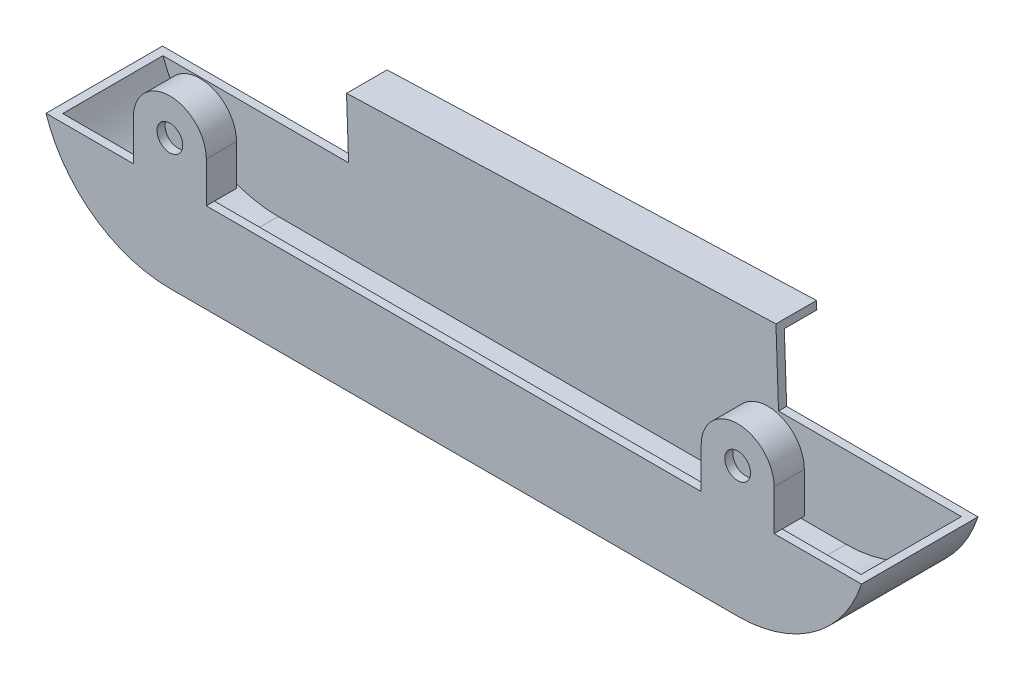
ISO-10303-21;
HEADER;
FILE_DESCRIPTION(('STEP AP214'),'2;1');
FILE_NAME('part.step','',(''),(''),'','','');
FILE_SCHEMA(('AUTOMOTIVE_DESIGN { 1 0 10303 214 1 1 1 1 }'));
ENDSEC;
DATA;
#1=APPLICATION_CONTEXT('core data for automotive mechanical design processes');
#2=APPLICATION_PROTOCOL_DEFINITION('international standard','automotive_design',2000,#1);
#3=PRODUCT_CONTEXT('',#1,'mechanical');
#4=PRODUCT('Part','Part','',(#3));
#5=PRODUCT_RELATED_PRODUCT_CATEGORY('part','',(#4));
#6=PRODUCT_DEFINITION_FORMATION('','',#4);
#7=PRODUCT_DEFINITION_CONTEXT('part definition',#1,'design');
#8=PRODUCT_DEFINITION('design','',#6,#7);
#9=PRODUCT_DEFINITION_SHAPE('','',#8);
#10=(LENGTH_UNIT() NAMED_UNIT(*) SI_UNIT(.MILLI.,.METRE.));
#11=(NAMED_UNIT(*) PLANE_ANGLE_UNIT() SI_UNIT($,.RADIAN.));
#12=(NAMED_UNIT(*) SI_UNIT($,.STERADIAN.) SOLID_ANGLE_UNIT());
#13=UNCERTAINTY_MEASURE_WITH_UNIT(LENGTH_MEASURE(1.E-05),#10,'distance_accuracy_value','');
#14=(GEOMETRIC_REPRESENTATION_CONTEXT(3) GLOBAL_UNCERTAINTY_ASSIGNED_CONTEXT((#13)) GLOBAL_UNIT_ASSIGNED_CONTEXT((#10,
#11,#12)) REPRESENTATION_CONTEXT('',''));
#15=CARTESIAN_POINT('',(0.,0.,0.));
#16=DIRECTION('',(0.,0.,1.));
#17=DIRECTION('',(1.,0.,0.));
#18=AXIS2_PLACEMENT_3D('',#15,#16,#17);
#19=CARTESIAN_POINT('',(0.,0.,0.));
#20=DIRECTION('',(0.,0.,1.));
#21=DIRECTION('',(1.,0.,0.));
#22=AXIS2_PLACEMENT_3D('',#19,#20,#21);
#23=PLANE('',#22);
#24=DIRECTION('',(-0.999389311897367,-0.0349428571428573,0.));
#25=VECTOR('',#24,1.);
#26=CARTESIAN_POINT('',(131.958867441707,15.7356294154201,0.));
#27=LINE('',#26,#25);
#28=CARTESIAN_POINT('',(131.958867441707,15.7356294154201,0.));
#29=VERTEX_POINT('',#28);
#30=CARTESIAN_POINT('',(-132.735647155993,6.48079498805815,0.));
#31=VERTEX_POINT('',#30);
#32=EDGE_CURVE('E96',#29,#31,#27,.T.);
#33=ORIENTED_EDGE('',*,*,#32,.F.);
#34=DIRECTION('',(-0.0349428571428576,0.999389311897368,0.));
#35=VECTOR('',#34,1.);
#36=CARTESIAN_POINT('',(132.34725729885,4.62741721368103,0.));
#37=LINE('',#36,#35);
#38=CARTESIAN_POINT('',(133.383156517387,-25.,0.));
#39=VERTEX_POINT('',#38);
#40=EDGE_CURVE('E325',#39,#29,#37,.T.);
#41=ORIENTED_EDGE('',*,*,#40,.F.);
#42=DIRECTION('',(-1.,0.,0.));
#43=VECTOR('',#42,1.);
#44=CARTESIAN_POINT('',(0.,-25.,0.));
#45=LINE('',#44,#43);
#46=CARTESIAN_POINT('',(251.338111427059,-25.,0.));
#47=VERTEX_POINT('',#46);
#48=EDGE_CURVE('E523',#47,#39,#45,.T.);
#49=ORIENTED_EDGE('',*,*,#48,.F.);
#50=CARTESIAN_POINT('',(175.,0.,0.));
#51=DIRECTION('',(0.,0.,1.));
#52=DIRECTION('',(1.,0.,0.));
#53=AXIS2_PLACEMENT_3D('',#50,#51,#52);
#54=CIRCLE('',#53,80.3275000000001);
#55=CARTESIAN_POINT('',(175.,-80.3275000000001,0.));
#56=VERTEX_POINT('',#55);
#57=EDGE_CURVE('E530',#56,#47,#54,.T.);
#58=ORIENTED_EDGE('',*,*,#57,.F.);
#59=DIRECTION('',(1.,0.,0.));
#60=VECTOR('',#59,1.);
#61=CARTESIAN_POINT('',(0.,-80.3275,0.));
#62=LINE('',#61,#60);
#63=CARTESIAN_POINT('',(-175.,-80.3275,0.));
#64=VERTEX_POINT('',#63);
#65=EDGE_CURVE('E528',#64,#56,#62,.T.);
#66=ORIENTED_EDGE('',*,*,#65,.F.);
#67=CARTESIAN_POINT('',(-175.,0.,0.));
#68=DIRECTION('',(0.,0.,1.));
#69=DIRECTION('',(1.,0.,0.));
#70=AXIS2_PLACEMENT_3D('',#67,#68,#69);
#71=CIRCLE('',#70,80.3275);
#72=CARTESIAN_POINT('',(-251.338111427058,-25.,0.));
#73=VERTEX_POINT('',#72);
#74=EDGE_CURVE('E526',#73,#64,#71,.T.);
#75=ORIENTED_EDGE('',*,*,#74,.F.);
#76=CARTESIAN_POINT('',(-131.634946048911,-25.,0.));
#77=VERTEX_POINT('',#76);
#78=EDGE_CURVE('E501',#77,#73,#45,.T.);
#79=ORIENTED_EDGE('',*,*,#78,.F.);
#80=DIRECTION('',(-0.0349428571428568,0.999389311897368,0.));
#81=VECTOR('',#80,1.);
#82=CARTESIAN_POINT('',(-132.34725729885,-4.62741721368092,0.));
#83=LINE('',#82,#81);
#84=EDGE_CURVE('E322',#77,#31,#83,.T.);
#85=ORIENTED_EDGE('',*,*,#84,.T.);
#86=EDGE_LOOP('',(#33,#41,#49,#58,#66,#75,#79,#85));
#87=FACE_BOUND('',#86,.T.);
#88=ADVANCED_FACE('F78',(#87),#23,.F.);
#89=CARTESIAN_POINT('',(0.,-25.,71.818));
#90=DIRECTION('',(0.,-1.,0.));
#91=DIRECTION('',(1.,0.,0.));
#92=AXIS2_PLACEMENT_3D('',#89,#90,#91);
#93=PLANE('',#92);
#94=DIRECTION('',(0.,0.,-1.));
#95=VECTOR('',#94,1.);
#96=CARTESIAN_POINT('',(133.383156517387,-25.,275.191980288703));
#97=LINE('',#96,#95);
#98=CARTESIAN_POINT('',(133.383156517387,-25.,5.));
#99=VERTEX_POINT('',#98);
#100=EDGE_CURVE('E327',#99,#39,#97,.T.);
#101=ORIENTED_EDGE('',*,*,#100,.F.);
#102=DIRECTION('',(-1.,0.,0.));
#103=VECTOR('',#102,1.);
#104=CARTESIAN_POINT('',(0.,-25.,5.));
#105=LINE('',#104,#103);
#106=CARTESIAN_POINT('',(246.057949986261,-25.,5.));
#107=VERTEX_POINT('',#106);
#108=EDGE_CURVE('E478',#107,#99,#105,.T.);
#109=ORIENTED_EDGE('',*,*,#108,.F.);
#110=DIRECTION('',(0.,0.,-1.));
#111=VECTOR('',#110,1.);
#112=CARTESIAN_POINT('',(246.057949986261,-25.,66.818));
#113=LINE('',#112,#111);
#114=CARTESIAN_POINT('',(246.057949986261,-25.,66.818));
#115=VERTEX_POINT('',#114);
#116=EDGE_CURVE('E492',#115,#107,#113,.T.);
#117=ORIENTED_EDGE('',*,*,#116,.F.);
#118=DIRECTION('',(-1.,0.,0.));
#119=VECTOR('',#118,1.);
#120=CARTESIAN_POINT('',(0.,-25.,66.818));
#121=LINE('',#120,#119);
#122=CARTESIAN_POINT('',(197.465,-25.,66.818));
#123=VERTEX_POINT('',#122);
#124=EDGE_CURVE('E487',#115,#123,#121,.T.);
#125=ORIENTED_EDGE('',*,*,#124,.T.);
#126=DIRECTION('',(0.,0.,1.));
#127=VECTOR('',#126,1.);
#128=CARTESIAN_POINT('',(197.465,-25.,53.182));
#129=LINE('',#128,#127);
#130=CARTESIAN_POINT('',(197.465,-25.,71.818));
#131=VERTEX_POINT('',#130);
#132=EDGE_CURVE('E425',#123,#131,#129,.T.);
#133=ORIENTED_EDGE('',*,*,#132,.T.);
#134=DIRECTION('',(-1.,0.,0.));
#135=VECTOR('',#134,1.);
#136=CARTESIAN_POINT('',(0.,-25.,71.818));
#137=LINE('',#136,#135);
#138=CARTESIAN_POINT('',(251.338111427059,-25.,71.818));
#139=VERTEX_POINT('',#138);
#140=EDGE_CURVE('E511',#139,#131,#137,.T.);
#141=ORIENTED_EDGE('',*,*,#140,.F.);
#142=DIRECTION('',(0.,0.,-1.));
#143=VECTOR('',#142,1.);
#144=CARTESIAN_POINT('',(251.338111427059,-25.,71.818));
#145=LINE('',#144,#143);
#146=EDGE_CURVE('E522',#139,#47,#145,.T.);
#147=ORIENTED_EDGE('',*,*,#146,.T.);
#148=ORIENTED_EDGE('',*,*,#48,.T.);
#149=EDGE_LOOP('',(#101,#109,#117,#125,#133,#141,#147,#148));
#150=FACE_BOUND('',#149,.T.);
#151=ADVANCED_FACE('F632',(#150),#93,.F.);
#152=CARTESIAN_POINT('',(0.,-25.,53.182));
#153=DIRECTION('',(0.,1.,0.));
#154=DIRECTION('',(-1.,0.,0.));
#155=AXIS2_PLACEMENT_3D('',#152,#153,#154);
#156=PLANE('',#155);
#157=DIRECTION('',(0.,0.,1.));
#158=VECTOR('',#157,1.);
#159=CARTESIAN_POINT('',(-157.535,-25.,53.182));
#160=LINE('',#159,#158);
#161=CARTESIAN_POINT('',(-157.535,-25.,58.182));
#162=VERTEX_POINT('',#161);
#163=CARTESIAN_POINT('',(-157.535,-25.,66.818));
#164=VERTEX_POINT('',#163);
#165=EDGE_CURVE('E383',#162,#164,#160,.T.);
#166=ORIENTED_EDGE('',*,*,#165,.F.);
#167=DIRECTION('',(-1.,0.,0.));
#168=VECTOR('',#167,1.);
#169=CARTESIAN_POINT('',(0.,-25.,58.182));
#170=LINE('',#169,#168);
#171=CARTESIAN_POINT('',(-192.465,-25.,58.182));
#172=VERTEX_POINT('',#171);
#173=EDGE_CURVE('E379',#162,#172,#170,.T.);
#174=ORIENTED_EDGE('',*,*,#173,.T.);
#175=DIRECTION('',(0.,0.,1.));
#176=VECTOR('',#175,1.);
#177=CARTESIAN_POINT('',(-192.465,-25.,53.182));
#178=LINE('',#177,#176);
#179=CARTESIAN_POINT('',(-192.465,-25.,66.818));
#180=VERTEX_POINT('',#179);
#181=EDGE_CURVE('E389',#172,#180,#178,.T.);
#182=ORIENTED_EDGE('',*,*,#181,.T.);
#183=CARTESIAN_POINT('',(-197.465,-25.,66.818));
#184=VERTEX_POINT('',#183);
#185=EDGE_CURVE('E505',#180,#184,#121,.T.);
#186=ORIENTED_EDGE('',*,*,#185,.T.);
#187=DIRECTION('',(0.,0.,1.));
#188=VECTOR('',#187,1.);
#189=CARTESIAN_POINT('',(-197.465,-25.,53.182));
#190=LINE('',#189,#188);
#191=CARTESIAN_POINT('',(-197.465,-25.,53.182));
#192=VERTEX_POINT('',#191);
#193=EDGE_CURVE('E89',#192,#184,#190,.T.);
#194=ORIENTED_EDGE('',*,*,#193,.F.);
#195=DIRECTION('',(-1.,0.,0.));
#196=VECTOR('',#195,1.);
#197=CARTESIAN_POINT('',(0.,-25.,53.182));
#198=LINE('',#197,#196);
#199=CARTESIAN_POINT('',(-152.535,-25.,53.182));
#200=VERTEX_POINT('',#199);
#201=EDGE_CURVE('E454',#200,#192,#198,.T.);
#202=ORIENTED_EDGE('',*,*,#201,.F.);
#203=DIRECTION('',(0.,0.,1.));
#204=VECTOR('',#203,1.);
#205=CARTESIAN_POINT('',(-152.535,-25.,53.182));
#206=LINE('',#205,#204);
#207=CARTESIAN_POINT('',(-152.535,-25.,66.818));
#208=VERTEX_POINT('',#207);
#209=EDGE_CURVE('E470',#200,#208,#206,.T.);
#210=ORIENTED_EDGE('',*,*,#209,.T.);
#211=EDGE_CURVE('E506',#208,#164,#121,.T.);
#212=ORIENTED_EDGE('',*,*,#211,.T.);
#213=EDGE_LOOP('',(#166,#174,#182,#186,#194,#202,#210,#212));
#214=FACE_BOUND('',#213,.T.);
#215=ADVANCED_FACE('F567',(#214),#156,.F.);
#216=CARTESIAN_POINT('',(0.,-25.,53.182));
#217=DIRECTION('',(0.,1.,0.));
#218=DIRECTION('',(-1.,0.,0.));
#219=AXIS2_PLACEMENT_3D('',#216,#217,#218);
#220=PLANE('',#219);
#221=DIRECTION('',(0.,0.,1.));
#222=VECTOR('',#221,1.);
#223=CARTESIAN_POINT('',(192.465,-25.,53.182));
#224=LINE('',#223,#222);
#225=CARTESIAN_POINT('',(192.465,-25.,58.182));
#226=VERTEX_POINT('',#225);
#227=CARTESIAN_POINT('',(192.465,-25.,66.818));
#228=VERTEX_POINT('',#227);
#229=EDGE_CURVE('E397',#226,#228,#224,.T.);
#230=ORIENTED_EDGE('',*,*,#229,.F.);
#231=DIRECTION('',(-1.,0.,0.));
#232=VECTOR('',#231,1.);
#233=CARTESIAN_POINT('',(0.,-25.,58.182));
#234=LINE('',#233,#232);
#235=CARTESIAN_POINT('',(157.535,-25.,58.182));
#236=VERTEX_POINT('',#235);
#237=EDGE_CURVE('E394',#226,#236,#234,.T.);
#238=ORIENTED_EDGE('',*,*,#237,.T.);
#239=DIRECTION('',(0.,0.,1.));
#240=VECTOR('',#239,1.);
#241=CARTESIAN_POINT('',(157.535,-25.,53.182));
#242=LINE('',#241,#240);
#243=CARTESIAN_POINT('',(157.535,-25.,66.818));
#244=VERTEX_POINT('',#243);
#245=EDGE_CURVE('E403',#236,#244,#242,.T.);
#246=ORIENTED_EDGE('',*,*,#245,.T.);
#247=CARTESIAN_POINT('',(152.535,-25.,66.818));
#248=VERTEX_POINT('',#247);
#249=EDGE_CURVE('E577',#244,#248,#121,.T.);
#250=ORIENTED_EDGE('',*,*,#249,.T.);
#251=DIRECTION('',(0.,0.,1.));
#252=VECTOR('',#251,1.);
#253=CARTESIAN_POINT('',(152.535,-25.,53.182));
#254=LINE('',#253,#252);
#255=CARTESIAN_POINT('',(152.535,-25.,53.182));
#256=VERTEX_POINT('',#255);
#257=EDGE_CURVE('E418',#256,#248,#254,.T.);
#258=ORIENTED_EDGE('',*,*,#257,.F.);
#259=DIRECTION('',(-1.,0.,0.));
#260=VECTOR('',#259,1.);
#261=CARTESIAN_POINT('',(0.,-25.,53.182));
#262=LINE('',#261,#260);
#263=CARTESIAN_POINT('',(197.465,-25.,53.182));
#264=VERTEX_POINT('',#263);
#265=EDGE_CURVE('E440',#264,#256,#262,.T.);
#266=ORIENTED_EDGE('',*,*,#265,.F.);
#267=EDGE_CURVE('E422',#264,#123,#129,.T.);
#268=ORIENTED_EDGE('',*,*,#267,.T.);
#269=EDGE_CURVE('E504',#123,#228,#121,.T.);
#270=ORIENTED_EDGE('',*,*,#269,.T.);
#271=EDGE_LOOP('',(#230,#238,#246,#250,#258,#266,#268,#270));
#272=FACE_BOUND('',#271,.T.);
#273=ADVANCED_FACE('F648',(#272),#220,.F.);
#274=CARTESIAN_POINT('',(-131.634946048911,-25.,5.));
#275=VERTEX_POINT('',#274);
#276=CARTESIAN_POINT('',(-246.057949986261,-25.,5.));
#277=VERTEX_POINT('',#276);
#278=EDGE_CURVE('E469',#275,#277,#105,.T.);
#279=ORIENTED_EDGE('',*,*,#278,.F.);
#280=DIRECTION('',(0.,0.,-1.));
#281=VECTOR('',#280,1.);
#282=CARTESIAN_POINT('',(-131.634946048911,-25.,275.191980288703));
#283=LINE('',#282,#281);
#284=EDGE_CURVE('E334',#275,#77,#283,.T.);
#285=ORIENTED_EDGE('',*,*,#284,.T.);
#286=ORIENTED_EDGE('',*,*,#78,.T.);
#287=DIRECTION('',(0.,0.,-1.));
#288=VECTOR('',#287,1.);
#289=CARTESIAN_POINT('',(-251.338111427058,-25.,71.818));
#290=LINE('',#289,#288);
#291=CARTESIAN_POINT('',(-251.338111427058,-25.,71.818));
#292=VERTEX_POINT('',#291);
#293=EDGE_CURVE('E540',#292,#73,#290,.T.);
#294=ORIENTED_EDGE('',*,*,#293,.F.);
#295=CARTESIAN_POINT('',(-197.465,-25.,71.818));
#296=VERTEX_POINT('',#295);
#297=EDGE_CURVE('E516',#296,#292,#137,.T.);
#298=ORIENTED_EDGE('',*,*,#297,.F.);
#299=EDGE_CURVE('E14',#184,#296,#190,.T.);
#300=ORIENTED_EDGE('',*,*,#299,.F.);
#301=CARTESIAN_POINT('',(-246.057949986261,-25.,66.818));
#302=VERTEX_POINT('',#301);
#303=EDGE_CURVE('E496',#184,#302,#121,.T.);
#304=ORIENTED_EDGE('',*,*,#303,.T.);
#305=DIRECTION('',(0.,0.,-1.));
#306=VECTOR('',#305,1.);
#307=CARTESIAN_POINT('',(-246.057949986261,-25.,66.818));
#308=LINE('',#307,#306);
#309=EDGE_CURVE('E482',#302,#277,#308,.T.);
#310=ORIENTED_EDGE('',*,*,#309,.T.);
#311=EDGE_LOOP('',(#279,#285,#286,#294,#298,#300,#304,#310));
#312=FACE_BOUND('',#311,.T.);
#313=ADVANCED_FACE('F612',(#312),#93,.F.);
#314=CARTESIAN_POINT('',(152.535,-25.,71.818));
#315=VERTEX_POINT('',#314);
#316=CARTESIAN_POINT('',(-152.535,-25.,71.818));
#317=VERTEX_POINT('',#316);
#318=EDGE_CURVE('E515',#315,#317,#137,.T.);
#319=ORIENTED_EDGE('',*,*,#318,.F.);
#320=EDGE_CURVE('E421',#248,#315,#254,.T.);
#321=ORIENTED_EDGE('',*,*,#320,.F.);
#322=EDGE_CURVE('E578',#248,#208,#121,.T.);
#323=ORIENTED_EDGE('',*,*,#322,.T.);
#324=EDGE_CURVE('E87',#208,#317,#206,.T.);
#325=ORIENTED_EDGE('',*,*,#324,.T.);
#326=EDGE_LOOP('',(#319,#321,#323,#325));
#327=FACE_BOUND('',#326,.T.);
#328=ADVANCED_FACE('F80',(#327),#93,.F.);
#329=CARTESIAN_POINT('',(-175.,0.,71.818));
#330=DIRECTION('',(0.,0.,-1.));
#331=DIRECTION('',(-1.,0.,0.));
#332=AXIS2_PLACEMENT_3D('',#329,#330,#331);
#333=CYLINDRICAL_SURFACE('',#332,80.3275);
#334=ORIENTED_EDGE('',*,*,#74,.T.);
#335=DIRECTION('',(0.,0.,-1.));
#336=VECTOR('',#335,1.);
#337=CARTESIAN_POINT('',(-175.,-80.3275,71.818));
#338=LINE('',#337,#336);
#339=CARTESIAN_POINT('',(-175.,-80.3275,71.818));
#340=VERTEX_POINT('',#339);
#341=EDGE_CURVE('E537',#340,#64,#338,.T.);
#342=ORIENTED_EDGE('',*,*,#341,.F.);
#343=CARTESIAN_POINT('',(-175.,0.,71.818));
#344=DIRECTION('',(0.,0.,1.));
#345=DIRECTION('',(1.,0.,0.));
#346=AXIS2_PLACEMENT_3D('',#343,#344,#345);
#347=CIRCLE('',#346,80.3275);
#348=EDGE_CURVE('E514',#292,#340,#347,.T.);
#349=ORIENTED_EDGE('',*,*,#348,.F.);
#350=ORIENTED_EDGE('',*,*,#293,.T.);
#351=EDGE_LOOP('',(#334,#342,#349,#350));
#352=FACE_BOUND('',#351,.T.);
#353=ADVANCED_FACE('F616',(#352),#333,.T.);
#354=CARTESIAN_POINT('',(0.,-80.3275,71.818));
#355=DIRECTION('',(0.,1.,0.));
#356=DIRECTION('',(0.,0.,1.));
#357=AXIS2_PLACEMENT_3D('',#354,#355,#356);
#358=PLANE('',#357);
#359=ORIENTED_EDGE('',*,*,#65,.T.);
#360=DIRECTION('',(0.,0.,-1.));
#361=VECTOR('',#360,1.);
#362=CARTESIAN_POINT('',(175.,-80.3275000000001,71.818));
#363=LINE('',#362,#361);
#364=CARTESIAN_POINT('',(175.,-80.3275000000001,71.818));
#365=VERTEX_POINT('',#364);
#366=EDGE_CURVE('E534',#365,#56,#363,.T.);
#367=ORIENTED_EDGE('',*,*,#366,.F.);
#368=DIRECTION('',(1.,0.,0.));
#369=VECTOR('',#368,1.);
#370=CARTESIAN_POINT('',(0.,-80.3275,71.818));
#371=LINE('',#370,#369);
#372=EDGE_CURVE('E518',#340,#365,#371,.T.);
#373=ORIENTED_EDGE('',*,*,#372,.F.);
#374=ORIENTED_EDGE('',*,*,#341,.T.);
#375=EDGE_LOOP('',(#359,#367,#373,#374));
#376=FACE_BOUND('',#375,.T.);
#377=ADVANCED_FACE('F623',(#376),#358,.F.);
#378=CARTESIAN_POINT('',(175.,0.,71.818));
#379=DIRECTION('',(0.,0.,-1.));
#380=DIRECTION('',(-1.,0.,0.));
#381=AXIS2_PLACEMENT_3D('',#378,#379,#380);
#382=CYLINDRICAL_SURFACE('',#381,80.3275000000001);
#383=ORIENTED_EDGE('',*,*,#57,.T.);
#384=ORIENTED_EDGE('',*,*,#146,.F.);
#385=CARTESIAN_POINT('',(175.,0.,71.818));
#386=DIRECTION('',(0.,0.,1.));
#387=DIRECTION('',(1.,0.,0.));
#388=AXIS2_PLACEMENT_3D('',#385,#386,#387);
#389=CIRCLE('',#388,80.3275000000001);
#390=EDGE_CURVE('E520',#365,#139,#389,.T.);
#391=ORIENTED_EDGE('',*,*,#390,.F.);
#392=ORIENTED_EDGE('',*,*,#366,.T.);
#393=EDGE_LOOP('',(#383,#384,#391,#392));
#394=FACE_BOUND('',#393,.T.);
#395=ADVANCED_FACE('F627',(#394),#382,.T.);
#396=CARTESIAN_POINT('',(0.,0.,71.818));
#397=DIRECTION('',(0.,0.,1.));
#398=DIRECTION('',(1.,0.,0.));
#399=AXIS2_PLACEMENT_3D('',#396,#397,#398);
#400=PLANE('',#399);
#401=CARTESIAN_POINT('',(175.,0.,71.818));
#402=DIRECTION('',(0.,0.,1.));
#403=DIRECTION('',(1.,0.,0.));
#404=AXIS2_PLACEMENT_3D('',#401,#402,#403);
#405=CIRCLE('',#404,7.93749999999998);
#406=CARTESIAN_POINT('',(182.9375,0.,71.818));
#407=VERTEX_POINT('',#406);
#408=EDGE_CURVE('E338',#407,#407,#405,.T.);
#409=ORIENTED_EDGE('',*,*,#408,.F.);
#410=EDGE_LOOP('',(#409));
#411=FACE_BOUND('',#410,.T.);
#412=CARTESIAN_POINT('',(-175.,0.,71.818));
#413=DIRECTION('',(0.,0.,1.));
#414=DIRECTION('',(1.,0.,0.));
#415=AXIS2_PLACEMENT_3D('',#412,#413,#414);
#416=CIRCLE('',#415,7.93749999999998);
#417=CARTESIAN_POINT('',(-167.0625,0.,71.818));
#418=VERTEX_POINT('',#417);
#419=EDGE_CURVE('E332',#418,#418,#416,.T.);
#420=ORIENTED_EDGE('',*,*,#419,.F.);
#421=EDGE_LOOP('',(#420));
#422=FACE_BOUND('',#421,.T.);
#423=ORIENTED_EDGE('',*,*,#140,.T.);
#424=DIRECTION('',(0.,-1.,0.));
#425=VECTOR('',#424,1.);
#426=CARTESIAN_POINT('',(197.465,0.,71.818));
#427=LINE('',#426,#425);
#428=CARTESIAN_POINT('',(197.465,0.,71.818));
#429=VERTEX_POINT('',#428);
#430=EDGE_CURVE('E427',#429,#131,#427,.T.);
#431=ORIENTED_EDGE('',*,*,#430,.F.);
#432=CARTESIAN_POINT('',(175.,0.,71.818));
#433=DIRECTION('',(0.,0.,1.));
#434=DIRECTION('',(1.,0.,0.));
#435=AXIS2_PLACEMENT_3D('',#432,#433,#434);
#436=CIRCLE('',#435,22.465);
#437=CARTESIAN_POINT('',(152.535,0.,71.818));
#438=VERTEX_POINT('',#437);
#439=EDGE_CURVE('E434',#429,#438,#436,.T.);
#440=ORIENTED_EDGE('',*,*,#439,.T.);
#441=DIRECTION('',(0.,-1.,0.));
#442=VECTOR('',#441,1.);
#443=CARTESIAN_POINT('',(152.535,0.,71.818));
#444=LINE('',#443,#442);
#445=EDGE_CURVE('E430',#438,#315,#444,.T.);
#446=ORIENTED_EDGE('',*,*,#445,.T.);
#447=ORIENTED_EDGE('',*,*,#318,.T.);
#448=DIRECTION('',(0.,-1.,0.));
#449=VECTOR('',#448,1.);
#450=CARTESIAN_POINT('',(-152.535,0.,71.818));
#451=LINE('',#450,#449);
#452=CARTESIAN_POINT('',(-152.535,0.,71.818));
#453=VERTEX_POINT('',#452);
#454=EDGE_CURVE('E451',#453,#317,#451,.T.);
#455=ORIENTED_EDGE('',*,*,#454,.F.);
#456=CARTESIAN_POINT('',(-175.,0.,71.818));
#457=DIRECTION('',(0.,0.,1.));
#458=DIRECTION('',(1.,0.,0.));
#459=AXIS2_PLACEMENT_3D('',#456,#457,#458);
#460=CIRCLE('',#459,22.465);
#461=CARTESIAN_POINT('',(-197.465,0.,71.818));
#462=VERTEX_POINT('',#461);
#463=EDGE_CURVE('E437',#453,#462,#460,.T.);
#464=ORIENTED_EDGE('',*,*,#463,.T.);
#465=DIRECTION('',(0.,-1.,0.));
#466=VECTOR('',#465,1.);
#467=CARTESIAN_POINT('',(-197.465,-2.19230189557606E-13,71.818));
#468=LINE('',#467,#466);
#469=EDGE_CURVE('E462',#462,#296,#468,.T.);
#470=ORIENTED_EDGE('',*,*,#469,.T.);
#471=ORIENTED_EDGE('',*,*,#297,.T.);
#472=ORIENTED_EDGE('',*,*,#348,.T.);
#473=ORIENTED_EDGE('',*,*,#372,.T.);
#474=ORIENTED_EDGE('',*,*,#390,.T.);
#475=EDGE_LOOP('',(#423,#431,#440,#446,#447,#455,#464,#470,#471,#472,#473,#474));
#476=FACE_BOUND('',#475,.T.);
#477=ADVANCED_FACE('F601',(#411,#422,#476),#400,.T.);
#478=CARTESIAN_POINT('',(-175.,0.,71.818));
#479=DIRECTION('',(0.,0.,-1.));
#480=DIRECTION('',(-1.,0.,0.));
#481=AXIS2_PLACEMENT_3D('',#478,#479,#480);
#482=CYLINDRICAL_SURFACE('',#481,75.3275);
#483=CARTESIAN_POINT('',(-175.,0.,5.));
#484=DIRECTION('',(0.,0.,1.));
#485=DIRECTION('',(1.,0.,0.));
#486=AXIS2_PLACEMENT_3D('',#483,#484,#485);
#487=CIRCLE('',#486,75.3275);
#488=CARTESIAN_POINT('',(-175.,-75.3275,5.));
#489=VERTEX_POINT('',#488);
#490=EDGE_CURVE('E475',#277,#489,#487,.T.);
#491=ORIENTED_EDGE('',*,*,#490,.F.);
#492=ORIENTED_EDGE('',*,*,#309,.F.);
#493=CARTESIAN_POINT('',(-175.,0.,66.818));
#494=DIRECTION('',(0.,0.,1.));
#495=DIRECTION('',(1.,0.,0.));
#496=AXIS2_PLACEMENT_3D('',#493,#494,#495);
#497=CIRCLE('',#496,75.3275);
#498=CARTESIAN_POINT('',(-175.,-75.3275,66.818));
#499=VERTEX_POINT('',#498);
#500=EDGE_CURVE('E484',#302,#499,#497,.T.);
#501=ORIENTED_EDGE('',*,*,#500,.T.);
#502=DIRECTION('',(0.,0.,1.));
#503=VECTOR('',#502,1.);
#504=CARTESIAN_POINT('',(-175.,-75.3275,71.818));
#505=LINE('',#504,#503);
#506=EDGE_CURVE('E479',#499,#489,#505,.F.);
#507=ORIENTED_EDGE('',*,*,#506,.T.);
#508=EDGE_LOOP('',(#491,#492,#501,#507));
#509=FACE_BOUND('',#508,.T.);
#510=ADVANCED_FACE('F871',(#509),#482,.F.);
#511=CARTESIAN_POINT('',(0.,-75.3275,71.818));
#512=DIRECTION('',(0.,1.,0.));
#513=DIRECTION('',(0.,0.,1.));
#514=AXIS2_PLACEMENT_3D('',#511,#512,#513);
#515=PLANE('',#514);
#516=DIRECTION('',(1.,0.,0.));
#517=VECTOR('',#516,1.);
#518=CARTESIAN_POINT('',(0.,-75.3275,5.));
#519=LINE('',#518,#517);
#520=CARTESIAN_POINT('',(175.,-75.3275,5.));
#521=VERTEX_POINT('',#520);
#522=EDGE_CURVE('E477',#489,#521,#519,.T.);
#523=ORIENTED_EDGE('',*,*,#522,.F.);
#524=ORIENTED_EDGE('',*,*,#506,.F.);
#525=DIRECTION('',(1.,0.,0.));
#526=VECTOR('',#525,1.);
#527=CARTESIAN_POINT('',(0.,-75.3275,66.818));
#528=LINE('',#527,#526);
#529=CARTESIAN_POINT('',(175.,-75.3275,66.818));
#530=VERTEX_POINT('',#529);
#531=EDGE_CURVE('E486',#499,#530,#528,.T.);
#532=ORIENTED_EDGE('',*,*,#531,.T.);
#533=DIRECTION('',(0.,0.,-1.));
#534=VECTOR('',#533,1.);
#535=CARTESIAN_POINT('',(175.,-75.3275,71.818));
#536=LINE('',#535,#534);
#537=EDGE_CURVE('E483',#530,#521,#536,.T.);
#538=ORIENTED_EDGE('',*,*,#537,.T.);
#539=EDGE_LOOP('',(#523,#524,#532,#538));
#540=FACE_BOUND('',#539,.T.);
#541=ADVANCED_FACE('F863',(#540),#515,.T.);
#542=CARTESIAN_POINT('',(175.,0.,71.818));
#543=DIRECTION('',(0.,0.,-1.));
#544=DIRECTION('',(-1.,0.,0.));
#545=AXIS2_PLACEMENT_3D('',#542,#543,#544);
#546=CYLINDRICAL_SURFACE('',#545,75.3275000000001);
#547=CARTESIAN_POINT('',(175.,0.,5.));
#548=DIRECTION('',(0.,0.,1.));
#549=DIRECTION('',(1.,0.,0.));
#550=AXIS2_PLACEMENT_3D('',#547,#548,#549);
#551=CIRCLE('',#550,75.3275000000001);
#552=EDGE_CURVE('E489',#521,#107,#551,.T.);
#553=ORIENTED_EDGE('',*,*,#552,.F.);
#554=ORIENTED_EDGE('',*,*,#537,.F.);
#555=CARTESIAN_POINT('',(175.,0.,66.818));
#556=DIRECTION('',(0.,0.,1.));
#557=DIRECTION('',(1.,0.,0.));
#558=AXIS2_PLACEMENT_3D('',#555,#556,#557);
#559=CIRCLE('',#558,75.3275000000001);
#560=EDGE_CURVE('E494',#530,#115,#559,.T.);
#561=ORIENTED_EDGE('',*,*,#560,.T.);
#562=ORIENTED_EDGE('',*,*,#116,.T.);
#563=EDGE_LOOP('',(#553,#554,#561,#562));
#564=FACE_BOUND('',#563,.T.);
#565=ADVANCED_FACE('F854',(#564),#546,.F.);
#566=CARTESIAN_POINT('',(0.,0.,66.818));
#567=DIRECTION('',(0.,0.,1.));
#568=DIRECTION('',(1.,0.,0.));
#569=AXIS2_PLACEMENT_3D('',#566,#567,#568);
#570=PLANE('',#569);
#571=CARTESIAN_POINT('',(175.,0.,66.818));
#572=DIRECTION('',(0.,0.,1.));
#573=DIRECTION('',(1.,0.,0.));
#574=AXIS2_PLACEMENT_3D('',#571,#572,#573);
#575=CIRCLE('',#574,7.93749999999998);
#576=CARTESIAN_POINT('',(182.9375,0.,66.818));
#577=VERTEX_POINT('',#576);
#578=EDGE_CURVE('E353',#577,#577,#575,.T.);
#579=ORIENTED_EDGE('',*,*,#578,.T.);
#580=EDGE_LOOP('',(#579));
#581=FACE_BOUND('',#580,.T.);
#582=CARTESIAN_POINT('',(-175.,0.,66.818));
#583=DIRECTION('',(0.,0.,1.));
#584=DIRECTION('',(1.,0.,0.));
#585=AXIS2_PLACEMENT_3D('',#582,#583,#584);
#586=CIRCLE('',#585,7.93749999999998);
#587=CARTESIAN_POINT('',(-167.0625,0.,66.818));
#588=VERTEX_POINT('',#587);
#589=EDGE_CURVE('E347',#588,#588,#586,.T.);
#590=ORIENTED_EDGE('',*,*,#589,.T.);
#591=EDGE_LOOP('',(#590));
#592=FACE_BOUND('',#591,.T.);
#593=ORIENTED_EDGE('',*,*,#124,.F.);
#594=ORIENTED_EDGE('',*,*,#560,.F.);
#595=ORIENTED_EDGE('',*,*,#531,.F.);
#596=ORIENTED_EDGE('',*,*,#500,.F.);
#597=ORIENTED_EDGE('',*,*,#303,.F.);
#598=ORIENTED_EDGE('',*,*,#185,.F.);
#599=DIRECTION('',(0.,-1.,0.));
#600=VECTOR('',#599,1.);
#601=CARTESIAN_POINT('',(-192.465,-2.13679074434481E-13,66.818));
#602=LINE('',#601,#600);
#603=CARTESIAN_POINT('',(-192.465,0.,66.818));
#604=VERTEX_POINT('',#603);
#605=EDGE_CURVE('E371',#604,#180,#602,.T.);
#606=ORIENTED_EDGE('',*,*,#605,.F.);
#607=CARTESIAN_POINT('',(-175.,0.,66.818));
#608=DIRECTION('',(0.,0.,1.));
#609=DIRECTION('',(1.,0.,0.));
#610=AXIS2_PLACEMENT_3D('',#607,#608,#609);
#611=CIRCLE('',#610,17.465);
#612=CARTESIAN_POINT('',(-157.535,0.,66.818));
#613=VERTEX_POINT('',#612);
#614=EDGE_CURVE('E365',#613,#604,#611,.T.);
#615=ORIENTED_EDGE('',*,*,#614,.F.);
#616=DIRECTION('',(0.,-1.,0.));
#617=VECTOR('',#616,1.);
#618=CARTESIAN_POINT('',(-157.535,0.,66.818));
#619=LINE('',#618,#617);
#620=EDGE_CURVE('E367',#613,#164,#619,.T.);
#621=ORIENTED_EDGE('',*,*,#620,.T.);
#622=ORIENTED_EDGE('',*,*,#211,.F.);
#623=ORIENTED_EDGE('',*,*,#322,.F.);
#624=ORIENTED_EDGE('',*,*,#249,.F.);
#625=DIRECTION('',(0.,-1.,0.));
#626=VECTOR('',#625,1.);
#627=CARTESIAN_POINT('',(157.535,0.,66.818));
#628=LINE('',#627,#626);
#629=CARTESIAN_POINT('',(157.535,0.,66.818));
#630=VERTEX_POINT('',#629);
#631=EDGE_CURVE('E360',#630,#244,#628,.T.);
#632=ORIENTED_EDGE('',*,*,#631,.F.);
#633=CARTESIAN_POINT('',(175.,0.,66.818));
#634=DIRECTION('',(0.,0.,1.));
#635=DIRECTION('',(1.,0.,0.));
#636=AXIS2_PLACEMENT_3D('',#633,#634,#635);
#637=CIRCLE('',#636,17.465);
#638=CARTESIAN_POINT('',(192.465,0.,66.818));
#639=VERTEX_POINT('',#638);
#640=EDGE_CURVE('E362',#639,#630,#637,.T.);
#641=ORIENTED_EDGE('',*,*,#640,.F.);
#642=DIRECTION('',(0.,-1.,0.));
#643=VECTOR('',#642,1.);
#644=CARTESIAN_POINT('',(192.465,0.,66.818));
#645=LINE('',#644,#643);
#646=EDGE_CURVE('E357',#639,#228,#645,.T.);
#647=ORIENTED_EDGE('',*,*,#646,.T.);
#648=ORIENTED_EDGE('',*,*,#269,.F.);
#649=EDGE_LOOP('',(#593,#594,#595,#596,#597,#598,#606,#615,#621,#622,#623,#624,#632,#641,#647,#648));
#650=FACE_BOUND('',#649,.T.);
#651=ADVANCED_FACE('F573',(#581,#592,#650),#570,.F.);
#652=CARTESIAN_POINT('',(0.,0.,5.));
#653=DIRECTION('',(0.,0.,1.));
#654=DIRECTION('',(1.,0.,0.));
#655=AXIS2_PLACEMENT_3D('',#652,#653,#654);
#656=PLANE('',#655);
#657=ORIENTED_EDGE('',*,*,#108,.T.);
#658=DIRECTION('',(-0.0349428571428576,0.999389311897368,0.));
#659=VECTOR('',#658,1.);
#660=CARTESIAN_POINT('',(132.34725729885,4.62741721368103,5.));
#661=LINE('',#660,#659);
#662=CARTESIAN_POINT('',(131.784153155992,20.732575974907,5.));
#663=VERTEX_POINT('',#662);
#664=EDGE_CURVE('E324',#99,#663,#661,.T.);
#665=ORIENTED_EDGE('',*,*,#664,.T.);
#666=DIRECTION('',(0.999389311897368,0.034942857142857,0.));
#667=VECTOR('',#666,1.);
#668=CARTESIAN_POINT('',(-0.563104142857139,16.105158761226,5.));
#669=LINE('',#668,#667);
#670=CARTESIAN_POINT('',(-132.910361441707,11.4777415475451,5.));
#671=VERTEX_POINT('',#670);
#672=EDGE_CURVE('E296',#671,#663,#669,.T.);
#673=ORIENTED_EDGE('',*,*,#672,.F.);
#674=DIRECTION('',(-0.0349428571428568,0.999389311897368,0.));
#675=VECTOR('',#674,1.);
#676=CARTESIAN_POINT('',(-132.34725729885,-4.62741721368092,5.));
#677=LINE('',#676,#675);
#678=EDGE_CURVE('E104',#275,#671,#677,.T.);
#679=ORIENTED_EDGE('',*,*,#678,.F.);
#680=ORIENTED_EDGE('',*,*,#278,.T.);
#681=ORIENTED_EDGE('',*,*,#490,.T.);
#682=ORIENTED_EDGE('',*,*,#522,.T.);
#683=ORIENTED_EDGE('',*,*,#552,.T.);
#684=EDGE_LOOP('',(#657,#665,#673,#679,#680,#681,#682,#683));
#685=FACE_BOUND('',#684,.T.);
#686=ADVANCED_FACE('F843',(#685),#656,.T.);
#687=CARTESIAN_POINT('',(-175.,0.,53.182));
#688=DIRECTION('',(0.,0.,1.));
#689=DIRECTION('',(1.,0.,0.));
#690=AXIS2_PLACEMENT_3D('',#687,#688,#689);
#691=CYLINDRICAL_SURFACE('',#690,22.465);
#692=ORIENTED_EDGE('',*,*,#463,.F.);
#693=DIRECTION('',(0.,0.,1.));
#694=VECTOR('',#693,1.);
#695=CARTESIAN_POINT('',(-152.535,0.,53.182));
#696=LINE('',#695,#694);
#697=CARTESIAN_POINT('',(-152.535,0.,53.182));
#698=VERTEX_POINT('',#697);
#699=EDGE_CURVE('E467',#698,#453,#696,.T.);
#700=ORIENTED_EDGE('',*,*,#699,.F.);
#701=CARTESIAN_POINT('',(-175.,0.,53.182));
#702=DIRECTION('',(0.,0.,1.));
#703=DIRECTION('',(1.,0.,0.));
#704=AXIS2_PLACEMENT_3D('',#701,#702,#703);
#705=CIRCLE('',#704,22.465);
#706=CARTESIAN_POINT('',(-197.465,0.,53.182));
#707=VERTEX_POINT('',#706);
#708=EDGE_CURVE('E447',#698,#707,#705,.T.);
#709=ORIENTED_EDGE('',*,*,#708,.T.);
#710=DIRECTION('',(0.,0.,1.));
#711=VECTOR('',#710,1.);
#712=CARTESIAN_POINT('',(-197.465,0.,53.182));
#713=LINE('',#712,#711);
#714=EDGE_CURVE('E459',#707,#462,#713,.T.);
#715=ORIENTED_EDGE('',*,*,#714,.T.);
#716=EDGE_LOOP('',(#692,#700,#709,#715));
#717=FACE_BOUND('',#716,.T.);
#718=ADVANCED_FACE('F602',(#717),#691,.T.);
#719=CARTESIAN_POINT('',(-152.535,0.,53.182));
#720=DIRECTION('',(-1.,0.,0.));
#721=DIRECTION('',(0.,0.,1.));
#722=AXIS2_PLACEMENT_3D('',#719,#720,#721);
#723=PLANE('',#722);
#724=ORIENTED_EDGE('',*,*,#454,.T.);
#725=ORIENTED_EDGE('',*,*,#324,.F.);
#726=ORIENTED_EDGE('',*,*,#209,.F.);
#727=DIRECTION('',(0.,-1.,0.));
#728=VECTOR('',#727,1.);
#729=CARTESIAN_POINT('',(-152.535,0.,53.182));
#730=LINE('',#729,#728);
#731=EDGE_CURVE('E456',#698,#200,#730,.T.);
#732=ORIENTED_EDGE('',*,*,#731,.F.);
#733=ORIENTED_EDGE('',*,*,#699,.T.);
#734=EDGE_LOOP('',(#724,#725,#726,#732,#733));
#735=FACE_BOUND('',#734,.T.);
#736=ADVANCED_FACE('F591',(#735),#723,.F.);
#737=CARTESIAN_POINT('',(-197.465,-2.19230189557606E-13,53.182));
#738=DIRECTION('',(-1.,0.,0.));
#739=DIRECTION('',(0.,-1.,0.));
#740=AXIS2_PLACEMENT_3D('',#737,#738,#739);
#741=PLANE('',#740);
#742=ORIENTED_EDGE('',*,*,#469,.F.);
#743=ORIENTED_EDGE('',*,*,#714,.F.);
#744=DIRECTION('',(0.,-1.,0.));
#745=VECTOR('',#744,1.);
#746=CARTESIAN_POINT('',(-197.465,-2.19230189557606E-13,53.182));
#747=LINE('',#746,#745);
#748=EDGE_CURVE('E450',#707,#192,#747,.T.);
#749=ORIENTED_EDGE('',*,*,#748,.T.);
#750=ORIENTED_EDGE('',*,*,#193,.T.);
#751=ORIENTED_EDGE('',*,*,#299,.T.);
#752=EDGE_LOOP('',(#742,#743,#749,#750,#751));
#753=FACE_BOUND('',#752,.T.);
#754=ADVANCED_FACE('F605',(#753),#741,.T.);
#755=CARTESIAN_POINT('',(0.,0.,53.182));
#756=DIRECTION('',(0.,0.,1.));
#757=DIRECTION('',(1.,0.,0.));
#758=AXIS2_PLACEMENT_3D('',#755,#756,#757);
#759=PLANE('',#758);
#760=CARTESIAN_POINT('',(-175.,0.,53.182));
#761=DIRECTION('',(0.,0.,1.));
#762=DIRECTION('',(1.,0.,0.));
#763=AXIS2_PLACEMENT_3D('',#760,#761,#762);
#764=CIRCLE('',#763,7.93749999999998);
#765=CARTESIAN_POINT('',(-167.0625,0.,53.182));
#766=VERTEX_POINT('',#765);
#767=EDGE_CURVE('E344',#766,#766,#764,.T.);
#768=ORIENTED_EDGE('',*,*,#767,.T.);
#769=EDGE_LOOP('',(#768));
#770=FACE_BOUND('',#769,.T.);
#771=ORIENTED_EDGE('',*,*,#708,.F.);
#772=ORIENTED_EDGE('',*,*,#731,.T.);
#773=ORIENTED_EDGE('',*,*,#201,.T.);
#774=ORIENTED_EDGE('',*,*,#748,.F.);
#775=EDGE_LOOP('',(#771,#772,#773,#774));
#776=FACE_BOUND('',#775,.T.);
#777=ADVANCED_FACE('F597',(#770,#776),#759,.F.);
#778=CARTESIAN_POINT('',(175.,0.,53.182));
#779=DIRECTION('',(0.,0.,1.));
#780=DIRECTION('',(1.,0.,0.));
#781=AXIS2_PLACEMENT_3D('',#778,#779,#780);
#782=CYLINDRICAL_SURFACE('',#781,22.465);
#783=ORIENTED_EDGE('',*,*,#439,.F.);
#784=DIRECTION('',(0.,0.,1.));
#785=VECTOR('',#784,1.);
#786=CARTESIAN_POINT('',(197.465,0.,53.182));
#787=LINE('',#786,#785);
#788=CARTESIAN_POINT('',(197.465,0.,53.182));
#789=VERTEX_POINT('',#788);
#790=EDGE_CURVE('E382',#789,#429,#787,.T.);
#791=ORIENTED_EDGE('',*,*,#790,.F.);
#792=CARTESIAN_POINT('',(175.,0.,53.182));
#793=DIRECTION('',(0.,0.,1.));
#794=DIRECTION('',(1.,0.,0.));
#795=AXIS2_PLACEMENT_3D('',#792,#793,#794);
#796=CIRCLE('',#795,22.465);
#797=CARTESIAN_POINT('',(152.535,0.,53.182));
#798=VERTEX_POINT('',#797);
#799=EDGE_CURVE('E431',#789,#798,#796,.T.);
#800=ORIENTED_EDGE('',*,*,#799,.T.);
#801=DIRECTION('',(0.,0.,1.));
#802=VECTOR('',#801,1.);
#803=CARTESIAN_POINT('',(152.535,0.,53.182));
#804=LINE('',#803,#802);
#805=EDGE_CURVE('E415',#798,#438,#804,.T.);
#806=ORIENTED_EDGE('',*,*,#805,.T.);
#807=EDGE_LOOP('',(#783,#791,#800,#806));
#808=FACE_BOUND('',#807,.T.);
#809=ADVANCED_FACE('F642',(#808),#782,.T.);
#810=CARTESIAN_POINT('',(0.,0.,53.182));
#811=DIRECTION('',(0.,0.,1.));
#812=DIRECTION('',(1.,0.,0.));
#813=AXIS2_PLACEMENT_3D('',#810,#811,#812);
#814=PLANE('',#813);
#815=CARTESIAN_POINT('',(175.,0.,53.182));
#816=DIRECTION('',(0.,0.,1.));
#817=DIRECTION('',(1.,0.,0.));
#818=AXIS2_PLACEMENT_3D('',#815,#816,#817);
#819=CIRCLE('',#818,7.93749999999998);
#820=CARTESIAN_POINT('',(182.9375,0.,53.182));
#821=VERTEX_POINT('',#820);
#822=EDGE_CURVE('E350',#821,#821,#819,.T.);
#823=ORIENTED_EDGE('',*,*,#822,.T.);
#824=EDGE_LOOP('',(#823));
#825=FACE_BOUND('',#824,.T.);
#826=ORIENTED_EDGE('',*,*,#799,.F.);
#827=DIRECTION('',(0.,-1.,0.));
#828=VECTOR('',#827,1.);
#829=CARTESIAN_POINT('',(197.465,0.,53.182));
#830=LINE('',#829,#828);
#831=EDGE_CURVE('E417',#789,#264,#830,.T.);
#832=ORIENTED_EDGE('',*,*,#831,.T.);
#833=ORIENTED_EDGE('',*,*,#265,.T.);
#834=DIRECTION('',(0.,-1.,0.));
#835=VECTOR('',#834,1.);
#836=CARTESIAN_POINT('',(152.535,0.,53.182));
#837=LINE('',#836,#835);
#838=EDGE_CURVE('E442',#798,#256,#837,.T.);
#839=ORIENTED_EDGE('',*,*,#838,.F.);
#840=EDGE_LOOP('',(#826,#832,#833,#839));
#841=FACE_BOUND('',#840,.T.);
#842=ADVANCED_FACE('F650',(#825,#841),#814,.F.);
#843=CARTESIAN_POINT('',(197.465,0.,53.182));
#844=DIRECTION('',(-1.,0.,0.));
#845=DIRECTION('',(0.,0.,1.));
#846=AXIS2_PLACEMENT_3D('',#843,#844,#845);
#847=PLANE('',#846);
#848=ORIENTED_EDGE('',*,*,#430,.T.);
#849=ORIENTED_EDGE('',*,*,#132,.F.);
#850=ORIENTED_EDGE('',*,*,#267,.F.);
#851=ORIENTED_EDGE('',*,*,#831,.F.);
#852=ORIENTED_EDGE('',*,*,#790,.T.);
#853=EDGE_LOOP('',(#848,#849,#850,#851,#852));
#854=FACE_BOUND('',#853,.T.);
#855=ADVANCED_FACE('F637',(#854),#847,.F.);
#856=CARTESIAN_POINT('',(152.535,0.,53.182));
#857=DIRECTION('',(-1.,0.,0.));
#858=DIRECTION('',(0.,0.,1.));
#859=AXIS2_PLACEMENT_3D('',#856,#857,#858);
#860=PLANE('',#859);
#861=ORIENTED_EDGE('',*,*,#445,.F.);
#862=ORIENTED_EDGE('',*,*,#805,.F.);
#863=ORIENTED_EDGE('',*,*,#838,.T.);
#864=ORIENTED_EDGE('',*,*,#257,.T.);
#865=ORIENTED_EDGE('',*,*,#320,.T.);
#866=EDGE_LOOP('',(#861,#862,#863,#864,#865));
#867=FACE_BOUND('',#866,.T.);
#868=ADVANCED_FACE('F645',(#867),#860,.T.);
#869=CARTESIAN_POINT('',(175.,0.,53.182));
#870=DIRECTION('',(0.,0.,1.));
#871=DIRECTION('',(1.,0.,0.));
#872=AXIS2_PLACEMENT_3D('',#869,#870,#871);
#873=CYLINDRICAL_SURFACE('',#872,17.465);
#874=ORIENTED_EDGE('',*,*,#640,.T.);
#875=DIRECTION('',(0.,0.,1.));
#876=VECTOR('',#875,1.);
#877=CARTESIAN_POINT('',(157.535,0.,53.182));
#878=LINE('',#877,#876);
#879=CARTESIAN_POINT('',(157.535,0.,58.182));
#880=VERTEX_POINT('',#879);
#881=EDGE_CURVE('E395',#880,#630,#878,.T.);
#882=ORIENTED_EDGE('',*,*,#881,.F.);
#883=CARTESIAN_POINT('',(175.,0.,58.182));
#884=DIRECTION('',(0.,0.,1.));
#885=DIRECTION('',(1.,0.,0.));
#886=AXIS2_PLACEMENT_3D('',#883,#884,#885);
#887=CIRCLE('',#886,17.465);
#888=CARTESIAN_POINT('',(192.465,0.,58.182));
#889=VERTEX_POINT('',#888);
#890=EDGE_CURVE('E361',#889,#880,#887,.T.);
#891=ORIENTED_EDGE('',*,*,#890,.F.);
#892=DIRECTION('',(0.,0.,1.));
#893=VECTOR('',#892,1.);
#894=CARTESIAN_POINT('',(192.465,0.,53.182));
#895=LINE('',#894,#893);
#896=EDGE_CURVE('E356',#889,#639,#895,.T.);
#897=ORIENTED_EDGE('',*,*,#896,.T.);
#898=EDGE_LOOP('',(#874,#882,#891,#897));
#899=FACE_BOUND('',#898,.T.);
#900=ADVANCED_FACE('F693',(#899),#873,.F.);
#901=CARTESIAN_POINT('',(0.,0.,58.182));
#902=DIRECTION('',(0.,0.,1.));
#903=DIRECTION('',(1.,0.,0.));
#904=AXIS2_PLACEMENT_3D('',#901,#902,#903);
#905=PLANE('',#904);
#906=CARTESIAN_POINT('',(175.,0.,58.182));
#907=DIRECTION('',(0.,0.,1.));
#908=DIRECTION('',(1.,0.,0.));
#909=AXIS2_PLACEMENT_3D('',#906,#907,#908);
#910=CIRCLE('',#909,7.93749999999998);
#911=CARTESIAN_POINT('',(182.9375,0.,58.182));
#912=VERTEX_POINT('',#911);
#913=EDGE_CURVE('E82',#912,#912,#910,.T.);
#914=ORIENTED_EDGE('',*,*,#913,.F.);
#915=EDGE_LOOP('',(#914));
#916=FACE_BOUND('',#915,.T.);
#917=ORIENTED_EDGE('',*,*,#890,.T.);
#918=DIRECTION('',(0.,-1.,0.));
#919=VECTOR('',#918,1.);
#920=CARTESIAN_POINT('',(157.535,0.,58.182));
#921=LINE('',#920,#919);
#922=EDGE_CURVE('E400',#880,#236,#921,.T.);
#923=ORIENTED_EDGE('',*,*,#922,.T.);
#924=ORIENTED_EDGE('',*,*,#237,.F.);
#925=DIRECTION('',(0.,-1.,0.));
#926=VECTOR('',#925,1.);
#927=CARTESIAN_POINT('',(192.465,0.,58.182));
#928=LINE('',#927,#926);
#929=EDGE_CURVE('E391',#889,#226,#928,.T.);
#930=ORIENTED_EDGE('',*,*,#929,.F.);
#931=EDGE_LOOP('',(#917,#923,#924,#930));
#932=FACE_BOUND('',#931,.T.);
#933=ADVANCED_FACE('F554',(#916,#932),#905,.T.);
#934=CARTESIAN_POINT('',(192.465,0.,53.182));
#935=DIRECTION('',(-1.,0.,0.));
#936=DIRECTION('',(0.,0.,1.));
#937=AXIS2_PLACEMENT_3D('',#934,#935,#936);
#938=PLANE('',#937);
#939=ORIENTED_EDGE('',*,*,#646,.F.);
#940=ORIENTED_EDGE('',*,*,#896,.F.);
#941=ORIENTED_EDGE('',*,*,#929,.T.);
#942=ORIENTED_EDGE('',*,*,#229,.T.);
#943=EDGE_LOOP('',(#939,#940,#941,#942));
#944=FACE_BOUND('',#943,.T.);
#945=ADVANCED_FACE('F654',(#944),#938,.T.);
#946=CARTESIAN_POINT('',(157.535,0.,53.182));
#947=DIRECTION('',(-1.,0.,0.));
#948=DIRECTION('',(0.,0.,1.));
#949=AXIS2_PLACEMENT_3D('',#946,#947,#948);
#950=PLANE('',#949);
#951=ORIENTED_EDGE('',*,*,#245,.F.);
#952=ORIENTED_EDGE('',*,*,#922,.F.);
#953=ORIENTED_EDGE('',*,*,#881,.T.);
#954=ORIENTED_EDGE('',*,*,#631,.T.);
#955=EDGE_LOOP('',(#951,#952,#953,#954));
#956=FACE_BOUND('',#955,.T.);
#957=ADVANCED_FACE('F552',(#956),#950,.F.);
#958=CARTESIAN_POINT('',(0.,0.,58.182));
#959=DIRECTION('',(0.,0.,1.));
#960=DIRECTION('',(1.,0.,0.));
#961=AXIS2_PLACEMENT_3D('',#958,#959,#960);
#962=PLANE('',#961);
#963=CARTESIAN_POINT('',(-175.,0.,58.182));
#964=DIRECTION('',(0.,0.,1.));
#965=DIRECTION('',(1.,0.,0.));
#966=AXIS2_PLACEMENT_3D('',#963,#964,#965);
#967=CIRCLE('',#966,7.93749999999998);
#968=CARTESIAN_POINT('',(-167.0625,0.,58.182));
#969=VERTEX_POINT('',#968);
#970=EDGE_CURVE('E341',#969,#969,#967,.T.);
#971=ORIENTED_EDGE('',*,*,#970,.F.);
#972=EDGE_LOOP('',(#971));
#973=FACE_BOUND('',#972,.T.);
#974=CARTESIAN_POINT('',(-175.,0.,58.182));
#975=DIRECTION('',(0.,0.,1.));
#976=DIRECTION('',(1.,0.,0.));
#977=AXIS2_PLACEMENT_3D('',#974,#975,#976);
#978=CIRCLE('',#977,17.465);
#979=CARTESIAN_POINT('',(-157.535,0.,58.182));
#980=VERTEX_POINT('',#979);
#981=CARTESIAN_POINT('',(-192.465,0.,58.182));
#982=VERTEX_POINT('',#981);
#983=EDGE_CURVE('E370',#980,#982,#978,.T.);
#984=ORIENTED_EDGE('',*,*,#983,.T.);
#985=DIRECTION('',(0.,-1.,0.));
#986=VECTOR('',#985,1.);
#987=CARTESIAN_POINT('',(-192.465,-2.13679074434481E-13,58.182));
#988=LINE('',#987,#986);
#989=EDGE_CURVE('E386',#982,#172,#988,.T.);
#990=ORIENTED_EDGE('',*,*,#989,.T.);
#991=ORIENTED_EDGE('',*,*,#173,.F.);
#992=DIRECTION('',(0.,-1.,0.));
#993=VECTOR('',#992,1.);
#994=CARTESIAN_POINT('',(-157.535,0.,58.182));
#995=LINE('',#994,#993);
#996=EDGE_CURVE('E375',#980,#162,#995,.T.);
#997=ORIENTED_EDGE('',*,*,#996,.F.);
#998=EDGE_LOOP('',(#984,#990,#991,#997));
#999=FACE_BOUND('',#998,.T.);
#1000=ADVANCED_FACE('F548',(#973,#999),#962,.T.);
#1001=CARTESIAN_POINT('',(-192.465,-2.13679074434481E-13,53.182));
#1002=DIRECTION('',(-1.,0.,0.));
#1003=DIRECTION('',(0.,-1.,0.));
#1004=AXIS2_PLACEMENT_3D('',#1001,#1002,#1003);
#1005=PLANE('',#1004);
#1006=ORIENTED_EDGE('',*,*,#181,.F.);
#1007=ORIENTED_EDGE('',*,*,#989,.F.);
#1008=DIRECTION('',(0.,0.,1.));
#1009=VECTOR('',#1008,1.);
#1010=CARTESIAN_POINT('',(-192.465,0.,53.182));
#1011=LINE('',#1010,#1009);
#1012=EDGE_CURVE('E378',#982,#604,#1011,.T.);
#1013=ORIENTED_EDGE('',*,*,#1012,.T.);
#1014=ORIENTED_EDGE('',*,*,#605,.T.);
#1015=EDGE_LOOP('',(#1006,#1007,#1013,#1014));
#1016=FACE_BOUND('',#1015,.T.);
#1017=ADVANCED_FACE('F551',(#1016),#1005,.F.);
#1018=CARTESIAN_POINT('',(-157.535,0.,53.182));
#1019=DIRECTION('',(-1.,0.,0.));
#1020=DIRECTION('',(0.,0.,1.));
#1021=AXIS2_PLACEMENT_3D('',#1018,#1019,#1020);
#1022=PLANE('',#1021);
#1023=ORIENTED_EDGE('',*,*,#620,.F.);
#1024=DIRECTION('',(0.,0.,1.));
#1025=VECTOR('',#1024,1.);
#1026=CARTESIAN_POINT('',(-157.535,0.,53.182));
#1027=LINE('',#1026,#1025);
#1028=EDGE_CURVE('E380',#980,#613,#1027,.T.);
#1029=ORIENTED_EDGE('',*,*,#1028,.F.);
#1030=ORIENTED_EDGE('',*,*,#996,.T.);
#1031=ORIENTED_EDGE('',*,*,#165,.T.);
#1032=EDGE_LOOP('',(#1023,#1029,#1030,#1031));
#1033=FACE_BOUND('',#1032,.T.);
#1034=ADVANCED_FACE('F570',(#1033),#1022,.T.);
#1035=CARTESIAN_POINT('',(-175.,0.,53.182));
#1036=DIRECTION('',(0.,0.,1.));
#1037=DIRECTION('',(1.,0.,0.));
#1038=AXIS2_PLACEMENT_3D('',#1035,#1036,#1037);
#1039=CYLINDRICAL_SURFACE('',#1038,17.465);
#1040=ORIENTED_EDGE('',*,*,#614,.T.);
#1041=ORIENTED_EDGE('',*,*,#1012,.F.);
#1042=ORIENTED_EDGE('',*,*,#983,.F.);
#1043=ORIENTED_EDGE('',*,*,#1028,.T.);
#1044=EDGE_LOOP('',(#1040,#1041,#1042,#1043));
#1045=FACE_BOUND('',#1044,.T.);
#1046=ADVANCED_FACE('F560',(#1045),#1039,.F.);
#1047=CARTESIAN_POINT('',(-175.,0.,0.));
#1048=DIRECTION('',(0.,0.,1.));
#1049=DIRECTION('',(1.,0.,0.));
#1050=AXIS2_PLACEMENT_3D('',#1047,#1048,#1049);
#1051=CYLINDRICAL_SURFACE('',#1050,7.93749999999998);
#1052=ORIENTED_EDGE('',*,*,#970,.T.);
#1053=EDGE_LOOP('',(#1052));
#1054=FACE_BOUND('',#1053,.T.);
#1055=ORIENTED_EDGE('',*,*,#767,.F.);
#1056=EDGE_LOOP('',(#1055));
#1057=FACE_BOUND('',#1056,.T.);
#1058=ADVANCED_FACE('F545',(#1054,#1057),#1051,.F.);
#1059=CARTESIAN_POINT('',(175.,0.,0.));
#1060=DIRECTION('',(0.,0.,1.));
#1061=DIRECTION('',(1.,0.,0.));
#1062=AXIS2_PLACEMENT_3D('',#1059,#1060,#1061);
#1063=CYLINDRICAL_SURFACE('',#1062,7.93749999999998);
#1064=ORIENTED_EDGE('',*,*,#913,.T.);
#1065=EDGE_LOOP('',(#1064));
#1066=FACE_BOUND('',#1065,.T.);
#1067=ORIENTED_EDGE('',*,*,#822,.F.);
#1068=EDGE_LOOP('',(#1067));
#1069=FACE_BOUND('',#1068,.T.);
#1070=ADVANCED_FACE('F714',(#1066,#1069),#1063,.F.);
#1071=ORIENTED_EDGE('',*,*,#419,.T.);
#1072=EDGE_LOOP('',(#1071));
#1073=FACE_BOUND('',#1072,.T.);
#1074=ORIENTED_EDGE('',*,*,#589,.F.);
#1075=EDGE_LOOP('',(#1074));
#1076=FACE_BOUND('',#1075,.T.);
#1077=ADVANCED_FACE('F710',(#1073,#1076),#1051,.F.);
#1078=ORIENTED_EDGE('',*,*,#408,.T.);
#1079=EDGE_LOOP('',(#1078));
#1080=FACE_BOUND('',#1079,.T.);
#1081=ORIENTED_EDGE('',*,*,#578,.F.);
#1082=EDGE_LOOP('',(#1081));
#1083=FACE_BOUND('',#1082,.T.);
#1084=ADVANCED_FACE('F713',(#1080,#1083),#1063,.F.);
#1085=CARTESIAN_POINT('',(-0.563104142857139,16.105158761226,275.191980288703));
#1086=DIRECTION('',(-0.034942857142857,0.999389311897367,0.));
#1087=DIRECTION('',(-0.999389311897368,-0.034942857142857,0.));
#1088=AXIS2_PLACEMENT_3D('',#1085,#1086,#1087);
#1089=PLANE('',#1088);
#1090=DIRECTION('',(0.,0.,-1.));
#1091=VECTOR('',#1090,1.);
#1092=CARTESIAN_POINT('',(-132.910361441707,11.4777415475451,275.191980288703));
#1093=LINE('',#1092,#1091);
#1094=CARTESIAN_POINT('',(-132.910361441707,11.4777415475452,-20.));
#1095=VERTEX_POINT('',#1094);
#1096=EDGE_CURVE('E329',#671,#1095,#1093,.T.);
#1097=ORIENTED_EDGE('',*,*,#1096,.F.);
#1098=ORIENTED_EDGE('',*,*,#672,.T.);
#1099=DIRECTION('',(0.,0.,-1.));
#1100=VECTOR('',#1099,1.);
#1101=CARTESIAN_POINT('',(131.784153155992,20.732575974907,275.191980288703));
#1102=LINE('',#1101,#1100);
#1103=CARTESIAN_POINT('',(131.784153155992,20.732575974907,-20.));
#1104=VERTEX_POINT('',#1103);
#1105=EDGE_CURVE('E290',#663,#1104,#1102,.T.);
#1106=ORIENTED_EDGE('',*,*,#1105,.T.);
#1107=DIRECTION('',(0.999389311897367,0.0349428571428565,0.));
#1108=VECTOR('',#1107,1.);
#1109=CARTESIAN_POINT('',(-132.910361441707,11.4777415475452,-20.));
#1110=LINE('',#1109,#1108);
#1111=EDGE_CURVE('E295',#1095,#1104,#1110,.T.);
#1112=ORIENTED_EDGE('',*,*,#1111,.F.);
#1113=EDGE_LOOP('',(#1097,#1098,#1106,#1112));
#1114=FACE_BOUND('',#1113,.T.);
#1115=ADVANCED_FACE('F293',(#1114),#1089,.T.);
#1116=CARTESIAN_POINT('',(-132.34725729885,-4.62741721368092,275.191980288703));
#1117=DIRECTION('',(-0.999389311897368,-0.0349428571428568,0.));
#1118=DIRECTION('',(0.0349428571428568,-0.999389311897368,0.));
#1119=AXIS2_PLACEMENT_3D('',#1116,#1117,#1118);
#1120=PLANE('',#1119);
#1121=ORIENTED_EDGE('',*,*,#284,.F.);
#1122=ORIENTED_EDGE('',*,*,#678,.T.);
#1123=ORIENTED_EDGE('',*,*,#1096,.T.);
#1124=DIRECTION('',(-0.0349428571428541,0.999389311897368,0.));
#1125=VECTOR('',#1124,1.);
#1126=CARTESIAN_POINT('',(-132.735647155993,6.48079498805815,-20.));
#1127=LINE('',#1126,#1125);
#1128=CARTESIAN_POINT('',(-132.735647155993,6.48079498805815,-20.));
#1129=VERTEX_POINT('',#1128);
#1130=EDGE_CURVE('E312',#1129,#1095,#1127,.T.);
#1131=ORIENTED_EDGE('',*,*,#1130,.F.);
#1132=DIRECTION('',(0.,0.,1.));
#1133=VECTOR('',#1132,1.);
#1134=CARTESIAN_POINT('',(-132.735647155993,6.48079498805815,-20.));
#1135=LINE('',#1134,#1133);
#1136=EDGE_CURVE('E317',#1129,#31,#1135,.T.);
#1137=ORIENTED_EDGE('',*,*,#1136,.T.);
#1138=ORIENTED_EDGE('',*,*,#84,.F.);
#1139=EDGE_LOOP('',(#1121,#1122,#1123,#1131,#1137,#1138));
#1140=FACE_BOUND('',#1139,.T.);
#1141=ADVANCED_FACE('F721',(#1140),#1120,.T.);
#1142=CARTESIAN_POINT('',(132.34725729885,4.62741721368103,275.191980288703));
#1143=DIRECTION('',(-0.999389311897367,-0.0349428571428576,0.));
#1144=DIRECTION('',(0.0349428571428576,-0.999389311897368,0.));
#1145=AXIS2_PLACEMENT_3D('',#1142,#1143,#1144);
#1146=PLANE('',#1145);
#1147=ORIENTED_EDGE('',*,*,#664,.F.);
#1148=ORIENTED_EDGE('',*,*,#100,.T.);
#1149=ORIENTED_EDGE('',*,*,#40,.T.);
#1150=DIRECTION('',(0.,0.,1.));
#1151=VECTOR('',#1150,1.);
#1152=CARTESIAN_POINT('',(131.958867441707,15.7356294154201,-20.));
#1153=LINE('',#1152,#1151);
#1154=CARTESIAN_POINT('',(131.958867441707,15.7356294154201,-20.));
#1155=VERTEX_POINT('',#1154);
#1156=EDGE_CURVE('E304',#1155,#29,#1153,.T.);
#1157=ORIENTED_EDGE('',*,*,#1156,.F.);
#1158=DIRECTION('',(0.0349428571428556,-0.999389311897368,0.));
#1159=VECTOR('',#1158,1.);
#1160=CARTESIAN_POINT('',(131.784153155992,20.732575974907,-20.));
#1161=LINE('',#1160,#1159);
#1162=EDGE_CURVE('E301',#1104,#1155,#1161,.T.);
#1163=ORIENTED_EDGE('',*,*,#1162,.F.);
#1164=ORIENTED_EDGE('',*,*,#1105,.F.);
#1165=EDGE_LOOP('',(#1147,#1148,#1149,#1157,#1163,#1164));
#1166=FACE_BOUND('',#1165,.T.);
#1167=ADVANCED_FACE('F302',(#1166),#1146,.F.);
#1168=CARTESIAN_POINT('',(131.958867441707,15.7356294154201,-20.));
#1169=DIRECTION('',(-0.0349428571428573,0.999389311897368,0.));
#1170=DIRECTION('',(-0.999389311897368,-0.0349428571428573,0.));
#1171=AXIS2_PLACEMENT_3D('',#1168,#1169,#1170);
#1172=PLANE('',#1171);
#1173=ORIENTED_EDGE('',*,*,#32,.T.);
#1174=ORIENTED_EDGE('',*,*,#1136,.F.);
#1175=DIRECTION('',(-0.999389311897367,-0.0349428571428573,0.));
#1176=VECTOR('',#1175,1.);
#1177=CARTESIAN_POINT('',(131.958867441707,15.7356294154201,-20.));
#1178=LINE('',#1177,#1176);
#1179=EDGE_CURVE('E307',#1155,#1129,#1178,.T.);
#1180=ORIENTED_EDGE('',*,*,#1179,.F.);
#1181=ORIENTED_EDGE('',*,*,#1156,.T.);
#1182=EDGE_LOOP('',(#1173,#1174,#1180,#1181));
#1183=FACE_BOUND('',#1182,.T.);
#1184=ADVANCED_FACE('F727',(#1183),#1172,.F.);
#1185=CARTESIAN_POINT('',(0.,0.,-20.));
#1186=DIRECTION('',(0.,0.,-1.));
#1187=DIRECTION('',(-1.,0.,0.));
#1188=AXIS2_PLACEMENT_3D('',#1185,#1186,#1187);
#1189=PLANE('',#1188);
#1190=ORIENTED_EDGE('',*,*,#1111,.T.);
#1191=ORIENTED_EDGE('',*,*,#1162,.T.);
#1192=ORIENTED_EDGE('',*,*,#1179,.T.);
#1193=ORIENTED_EDGE('',*,*,#1130,.T.);
#1194=EDGE_LOOP('',(#1190,#1191,#1192,#1193));
#1195=FACE_BOUND('',#1194,.T.);
#1196=ADVANCED_FACE('F310',(#1195),#1189,.T.);
#1197=CLOSED_SHELL('',(#88,#151,#215,#273,#313,#328,#353,#377,#395,#477,#510,#541,#565,#651,
#686,#718,#736,#754,#777,#809,#842,#855,#868,#900,#933,#945,#957,#1000,#1017,#1034,#1046,#1058,
#1070,#1077,#1084,#1115,#1141,#1167,#1184,#1196));
#1198=MANIFOLD_SOLID_BREP('B2',#1197);
#1199=ADVANCED_BREP_SHAPE_REPRESENTATION('',(#18,#1198),#14);
#1200=SHAPE_DEFINITION_REPRESENTATION(#9,#1199);
ENDSEC;
END-ISO-10303-21;
